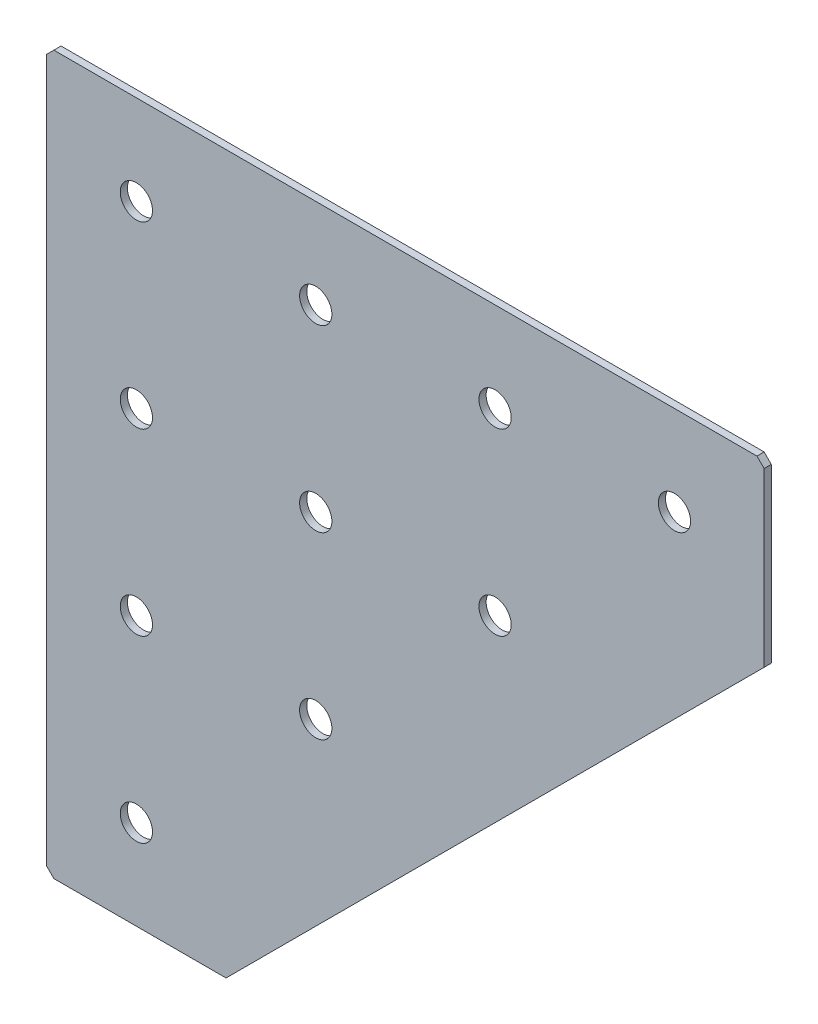
ISO-10303-21;
HEADER;
FILE_DESCRIPTION(('STEP AP214'),'2;1');
FILE_NAME('part.step','',(''),(''),'','','');
FILE_SCHEMA(('AUTOMOTIVE_DESIGN { 1 0 10303 214 1 1 1 1 }'));
ENDSEC;
DATA;
#1=APPLICATION_CONTEXT('core data for automotive mechanical design processes');
#2=APPLICATION_PROTOCOL_DEFINITION('international standard','automotive_design',2000,#1);
#3=PRODUCT_CONTEXT('',#1,'mechanical');
#4=PRODUCT('Part','Part','',(#3));
#5=PRODUCT_RELATED_PRODUCT_CATEGORY('part','',(#4));
#6=PRODUCT_DEFINITION_FORMATION('','',#4);
#7=PRODUCT_DEFINITION_CONTEXT('part definition',#1,'design');
#8=PRODUCT_DEFINITION('design','',#6,#7);
#9=PRODUCT_DEFINITION_SHAPE('','',#8);
#10=(LENGTH_UNIT() NAMED_UNIT(*) SI_UNIT(.MILLI.,.METRE.));
#11=(NAMED_UNIT(*) PLANE_ANGLE_UNIT() SI_UNIT($,.RADIAN.));
#12=(NAMED_UNIT(*) SI_UNIT($,.STERADIAN.) SOLID_ANGLE_UNIT());
#13=UNCERTAINTY_MEASURE_WITH_UNIT(LENGTH_MEASURE(1.E-05),#10,'distance_accuracy_value','');
#14=(GEOMETRIC_REPRESENTATION_CONTEXT(3) GLOBAL_UNCERTAINTY_ASSIGNED_CONTEXT((#13)) GLOBAL_UNIT_ASSIGNED_CONTEXT((#10,
#11,#12)) REPRESENTATION_CONTEXT('',''));
#15=CARTESIAN_POINT('',(0.,0.,0.));
#16=DIRECTION('',(0.,0.,1.));
#17=DIRECTION('',(1.,0.,0.));
#18=AXIS2_PLACEMENT_3D('',#15,#16,#17);
#19=CARTESIAN_POINT('',(0.,0.,0.));
#20=DIRECTION('',(0.,0.,-1.));
#21=DIRECTION('',(-1.,0.,0.));
#22=AXIS2_PLACEMENT_3D('',#19,#20,#21);
#23=PLANE('',#22);
#24=CARTESIAN_POINT('',(25.,-25.,0.));
#25=DIRECTION('',(0.,0.,1.));
#26=DIRECTION('',(1.,0.,0.));
#27=AXIS2_PLACEMENT_3D('',#24,#25,#26);
#28=CIRCLE('',#27,4.5);
#29=CARTESIAN_POINT('',(29.5,-25.,0.));
#30=VERTEX_POINT('',#29);
#31=EDGE_CURVE('E284',#30,#30,#28,.T.);
#32=ORIENTED_EDGE('',*,*,#31,.T.);
#33=EDGE_LOOP('',(#32));
#34=FACE_BOUND('',#33,.T.);
#35=CARTESIAN_POINT('',(75.,-25.,0.));
#36=DIRECTION('',(0.,0.,1.));
#37=DIRECTION('',(1.,0.,0.));
#38=AXIS2_PLACEMENT_3D('',#35,#36,#37);
#39=CIRCLE('',#38,4.5);
#40=CARTESIAN_POINT('',(79.5,-25.,0.));
#41=VERTEX_POINT('',#40);
#42=EDGE_CURVE('E276',#41,#41,#39,.T.);
#43=ORIENTED_EDGE('',*,*,#42,.T.);
#44=EDGE_LOOP('',(#43));
#45=FACE_BOUND('',#44,.T.);
#46=CARTESIAN_POINT('',(125.,-25.,0.));
#47=DIRECTION('',(0.,0.,1.));
#48=DIRECTION('',(1.,0.,0.));
#49=AXIS2_PLACEMENT_3D('',#46,#47,#48);
#50=CIRCLE('',#49,4.5);
#51=CARTESIAN_POINT('',(129.5,-25.,0.));
#52=VERTEX_POINT('',#51);
#53=EDGE_CURVE('E268',#52,#52,#50,.T.);
#54=ORIENTED_EDGE('',*,*,#53,.T.);
#55=EDGE_LOOP('',(#54));
#56=FACE_BOUND('',#55,.T.);
#57=CARTESIAN_POINT('',(175.,-25.,0.));
#58=DIRECTION('',(0.,0.,1.));
#59=DIRECTION('',(1.,0.,0.));
#60=AXIS2_PLACEMENT_3D('',#57,#58,#59);
#61=CIRCLE('',#60,4.5);
#62=CARTESIAN_POINT('',(179.5,-25.,0.));
#63=VERTEX_POINT('',#62);
#64=EDGE_CURVE('E260',#63,#63,#61,.T.);
#65=ORIENTED_EDGE('',*,*,#64,.T.);
#66=EDGE_LOOP('',(#65));
#67=FACE_BOUND('',#66,.T.);
#68=CARTESIAN_POINT('',(25.,-75.,0.));
#69=DIRECTION('',(0.,0.,1.));
#70=DIRECTION('',(1.,0.,0.));
#71=AXIS2_PLACEMENT_3D('',#68,#69,#70);
#72=CIRCLE('',#71,4.5);
#73=CARTESIAN_POINT('',(29.5,-75.,0.));
#74=VERTEX_POINT('',#73);
#75=EDGE_CURVE('E252',#74,#74,#72,.T.);
#76=ORIENTED_EDGE('',*,*,#75,.T.);
#77=EDGE_LOOP('',(#76));
#78=FACE_BOUND('',#77,.T.);
#79=CARTESIAN_POINT('',(25.,-125.,0.));
#80=DIRECTION('',(0.,0.,1.));
#81=DIRECTION('',(1.,0.,0.));
#82=AXIS2_PLACEMENT_3D('',#79,#80,#81);
#83=CIRCLE('',#82,4.5);
#84=CARTESIAN_POINT('',(29.5,-125.,0.));
#85=VERTEX_POINT('',#84);
#86=EDGE_CURVE('E244',#85,#85,#83,.T.);
#87=ORIENTED_EDGE('',*,*,#86,.T.);
#88=EDGE_LOOP('',(#87));
#89=FACE_BOUND('',#88,.T.);
#90=DIRECTION('',(1.,0.,0.));
#91=VECTOR('',#90,1.);
#92=CARTESIAN_POINT('',(0.,-200.,0.));
#93=LINE('',#92,#91);
#94=CARTESIAN_POINT('',(2.,-200.,0.));
#95=VERTEX_POINT('',#94);
#96=CARTESIAN_POINT('',(50.,-200.,0.));
#97=VERTEX_POINT('',#96);
#98=EDGE_CURVE('E127',#95,#97,#93,.T.);
#99=ORIENTED_EDGE('',*,*,#98,.F.);
#100=DIRECTION('',(0.707106781186543,-0.707106781186552,0.));
#101=VECTOR('',#100,1.);
#102=CARTESIAN_POINT('',(-99.,-98.9999999999986,0.));
#103=LINE('',#102,#101);
#104=CARTESIAN_POINT('',(0.,-198.,0.));
#105=VERTEX_POINT('',#104);
#106=EDGE_CURVE('E170',#95,#105,#103,.F.);
#107=ORIENTED_EDGE('',*,*,#106,.T.);
#108=DIRECTION('',(0.,-1.,0.));
#109=VECTOR('',#108,1.);
#110=CARTESIAN_POINT('',(0.,0.,0.));
#111=LINE('',#110,#109);
#112=CARTESIAN_POINT('',(0.,-1.99999999999997,0.));
#113=VERTEX_POINT('',#112);
#114=EDGE_CURVE('E146',#113,#105,#111,.T.);
#115=ORIENTED_EDGE('',*,*,#114,.F.);
#116=DIRECTION('',(-0.707106781186548,-0.707106781186548,0.));
#117=VECTOR('',#116,1.);
#118=CARTESIAN_POINT('',(0.999999999999987,-0.999999999999987,0.));
#119=LINE('',#118,#117);
#120=CARTESIAN_POINT('',(1.99999999999997,0.,0.));
#121=VERTEX_POINT('',#120);
#122=EDGE_CURVE('E167',#113,#121,#119,.F.);
#123=ORIENTED_EDGE('',*,*,#122,.T.);
#124=DIRECTION('',(-1.,0.,0.));
#125=VECTOR('',#124,1.);
#126=CARTESIAN_POINT('',(0.,0.,0.));
#127=LINE('',#126,#125);
#128=CARTESIAN_POINT('',(198.,0.,0.));
#129=VERTEX_POINT('',#128);
#130=EDGE_CURVE('E143',#129,#121,#127,.T.);
#131=ORIENTED_EDGE('',*,*,#130,.F.);
#132=DIRECTION('',(-0.707106781186548,0.707106781186548,0.));
#133=VECTOR('',#132,1.);
#134=CARTESIAN_POINT('',(99.,99.,0.));
#135=LINE('',#134,#133);
#136=CARTESIAN_POINT('',(200.,-2.00000000000003,0.));
#137=VERTEX_POINT('',#136);
#138=EDGE_CURVE('E164',#129,#137,#135,.F.);
#139=ORIENTED_EDGE('',*,*,#138,.T.);
#140=DIRECTION('',(0.,1.,0.));
#141=VECTOR('',#140,1.);
#142=CARTESIAN_POINT('',(200.,0.,0.));
#143=LINE('',#142,#141);
#144=CARTESIAN_POINT('',(200.,-50.,0.));
#145=VERTEX_POINT('',#144);
#146=EDGE_CURVE('E156',#145,#137,#143,.T.);
#147=ORIENTED_EDGE('',*,*,#146,.F.);
#148=DIRECTION('',(0.707106781186547,0.707106781186548,0.));
#149=VECTOR('',#148,1.);
#150=CARTESIAN_POINT('',(200.,-50.,0.));
#151=LINE('',#150,#149);
#152=EDGE_CURVE('E153',#97,#145,#151,.T.);
#153=ORIENTED_EDGE('',*,*,#152,.F.);
#154=EDGE_LOOP('',(#99,#107,#115,#123,#131,#139,#147,#153));
#155=FACE_BOUND('',#154,.T.);
#156=CARTESIAN_POINT('',(75.,-75.,0.));
#157=DIRECTION('',(0.,0.,1.));
#158=DIRECTION('',(1.,0.,0.));
#159=AXIS2_PLACEMENT_3D('',#156,#157,#158);
#160=CIRCLE('',#159,4.5);
#161=CARTESIAN_POINT('',(79.5,-75.,0.));
#162=VERTEX_POINT('',#161);
#163=EDGE_CURVE('E147',#162,#162,#160,.T.);
#164=ORIENTED_EDGE('',*,*,#163,.T.);
#165=EDGE_LOOP('',(#164));
#166=FACE_BOUND('',#165,.T.);
#167=CARTESIAN_POINT('',(125.,-75.,0.));
#168=DIRECTION('',(0.,0.,1.));
#169=DIRECTION('',(1.,0.,0.));
#170=AXIS2_PLACEMENT_3D('',#167,#168,#169);
#171=CIRCLE('',#170,4.5);
#172=CARTESIAN_POINT('',(129.5,-75.,0.));
#173=VERTEX_POINT('',#172);
#174=EDGE_CURVE('E220',#173,#173,#171,.T.);
#175=ORIENTED_EDGE('',*,*,#174,.T.);
#176=EDGE_LOOP('',(#175));
#177=FACE_BOUND('',#176,.T.);
#178=CARTESIAN_POINT('',(75.,-125.,0.));
#179=DIRECTION('',(0.,0.,1.));
#180=DIRECTION('',(1.,0.,0.));
#181=AXIS2_PLACEMENT_3D('',#178,#179,#180);
#182=CIRCLE('',#181,4.5);
#183=CARTESIAN_POINT('',(79.5,-125.,0.));
#184=VERTEX_POINT('',#183);
#185=EDGE_CURVE('E228',#184,#184,#182,.T.);
#186=ORIENTED_EDGE('',*,*,#185,.T.);
#187=EDGE_LOOP('',(#186));
#188=FACE_BOUND('',#187,.T.);
#189=CARTESIAN_POINT('',(25.,-175.,0.));
#190=DIRECTION('',(0.,0.,1.));
#191=DIRECTION('',(1.,0.,0.));
#192=AXIS2_PLACEMENT_3D('',#189,#190,#191);
#193=CIRCLE('',#192,4.5);
#194=CARTESIAN_POINT('',(29.5,-175.,0.));
#195=VERTEX_POINT('',#194);
#196=EDGE_CURVE('E236',#195,#195,#193,.T.);
#197=ORIENTED_EDGE('',*,*,#196,.T.);
#198=EDGE_LOOP('',(#197));
#199=FACE_BOUND('',#198,.T.);
#200=ADVANCED_FACE('F41',(#34,#45,#56,#67,#78,#89,#155,#166,#177,#188,#199),#23,.T.);
#201=CARTESIAN_POINT('',(0.,0.,2.));
#202=DIRECTION('',(0.,-1.,0.));
#203=DIRECTION('',(0.,0.,-1.));
#204=AXIS2_PLACEMENT_3D('',#201,#202,#203);
#205=PLANE('',#204);
#206=ORIENTED_EDGE('',*,*,#130,.T.);
#207=DIRECTION('',(0.,0.,1.));
#208=VECTOR('',#207,1.);
#209=CARTESIAN_POINT('',(1.99999999999997,0.,2.));
#210=LINE('',#209,#208);
#211=CARTESIAN_POINT('',(1.99999999999997,0.,2.));
#212=VERTEX_POINT('',#211);
#213=EDGE_CURVE('E51',#121,#212,#210,.T.);
#214=ORIENTED_EDGE('',*,*,#213,.T.);
#215=DIRECTION('',(-1.,0.,0.));
#216=VECTOR('',#215,1.);
#217=CARTESIAN_POINT('',(0.,0.,2.));
#218=LINE('',#217,#216);
#219=CARTESIAN_POINT('',(198.,0.,2.));
#220=VERTEX_POINT('',#219);
#221=EDGE_CURVE('E159',#220,#212,#218,.T.);
#222=ORIENTED_EDGE('',*,*,#221,.F.);
#223=DIRECTION('',(0.,0.,-1.));
#224=VECTOR('',#223,1.);
#225=CARTESIAN_POINT('',(198.,0.,2.));
#226=LINE('',#225,#224);
#227=EDGE_CURVE('E188',#220,#129,#226,.T.);
#228=ORIENTED_EDGE('',*,*,#227,.T.);
#229=EDGE_LOOP('',(#206,#214,#222,#228));
#230=FACE_BOUND('',#229,.T.);
#231=ADVANCED_FACE('F194',(#230),#205,.F.);
#232=CARTESIAN_POINT('',(0.,0.,2.));
#233=DIRECTION('',(1.,0.,0.));
#234=DIRECTION('',(0.,1.,0.));
#235=AXIS2_PLACEMENT_3D('',#232,#233,#234);
#236=PLANE('',#235);
#237=ORIENTED_EDGE('',*,*,#114,.T.);
#238=DIRECTION('',(0.,0.,1.));
#239=VECTOR('',#238,1.);
#240=CARTESIAN_POINT('',(0.,-198.,2.));
#241=LINE('',#240,#239);
#242=CARTESIAN_POINT('',(0.,-198.,2.));
#243=VERTEX_POINT('',#242);
#244=EDGE_CURVE('E177',#105,#243,#241,.T.);
#245=ORIENTED_EDGE('',*,*,#244,.T.);
#246=DIRECTION('',(0.,-1.,0.));
#247=VECTOR('',#246,1.);
#248=CARTESIAN_POINT('',(0.,0.,2.));
#249=LINE('',#248,#247);
#250=CARTESIAN_POINT('',(0.,-1.99999999999997,2.));
#251=VERTEX_POINT('',#250);
#252=EDGE_CURVE('E121',#251,#243,#249,.T.);
#253=ORIENTED_EDGE('',*,*,#252,.F.);
#254=DIRECTION('',(0.,0.,-1.));
#255=VECTOR('',#254,1.);
#256=CARTESIAN_POINT('',(0.,-1.99999999999997,2.));
#257=LINE('',#256,#255);
#258=EDGE_CURVE('E173',#251,#113,#257,.T.);
#259=ORIENTED_EDGE('',*,*,#258,.T.);
#260=EDGE_LOOP('',(#237,#245,#253,#259));
#261=FACE_BOUND('',#260,.T.);
#262=ADVANCED_FACE('F207',(#261),#236,.F.);
#263=CARTESIAN_POINT('',(0.,-200.,2.));
#264=DIRECTION('',(0.,1.,0.));
#265=DIRECTION('',(0.,0.,1.));
#266=AXIS2_PLACEMENT_3D('',#263,#264,#265);
#267=PLANE('',#266);
#268=DIRECTION('',(1.,0.,0.));
#269=VECTOR('',#268,1.);
#270=CARTESIAN_POINT('',(0.,-200.,2.));
#271=LINE('',#270,#269);
#272=CARTESIAN_POINT('',(2.,-200.,2.));
#273=VERTEX_POINT('',#272);
#274=CARTESIAN_POINT('',(50.,-200.,2.));
#275=VERTEX_POINT('',#274);
#276=EDGE_CURVE('E108',#273,#275,#271,.T.);
#277=ORIENTED_EDGE('',*,*,#276,.F.);
#278=DIRECTION('',(0.,0.,-1.));
#279=VECTOR('',#278,1.);
#280=CARTESIAN_POINT('',(2.,-200.,2.));
#281=LINE('',#280,#279);
#282=EDGE_CURVE('E131',#273,#95,#281,.T.);
#283=ORIENTED_EDGE('',*,*,#282,.T.);
#284=ORIENTED_EDGE('',*,*,#98,.T.);
#285=DIRECTION('',(0.,0.,-1.));
#286=VECTOR('',#285,1.);
#287=CARTESIAN_POINT('',(50.,-200.,2.));
#288=LINE('',#287,#286);
#289=EDGE_CURVE('E124',#275,#97,#288,.T.);
#290=ORIENTED_EDGE('',*,*,#289,.F.);
#291=EDGE_LOOP('',(#277,#283,#284,#290));
#292=FACE_BOUND('',#291,.T.);
#293=ADVANCED_FACE('F125',(#292),#267,.F.);
#294=CARTESIAN_POINT('',(200.,-50.,2.));
#295=DIRECTION('',(-0.707106781186548,0.707106781186547,0.));
#296=DIRECTION('',(-0.707106781186547,-0.707106781186548,0.));
#297=AXIS2_PLACEMENT_3D('',#294,#295,#296);
#298=PLANE('',#297);
#299=ORIENTED_EDGE('',*,*,#152,.T.);
#300=DIRECTION('',(0.,0.,-1.));
#301=VECTOR('',#300,1.);
#302=CARTESIAN_POINT('',(200.,-50.,2.));
#303=LINE('',#302,#301);
#304=CARTESIAN_POINT('',(200.,-50.,2.));
#305=VERTEX_POINT('',#304);
#306=EDGE_CURVE('E132',#305,#145,#303,.T.);
#307=ORIENTED_EDGE('',*,*,#306,.F.);
#308=DIRECTION('',(0.707106781186547,0.707106781186548,0.));
#309=VECTOR('',#308,1.);
#310=CARTESIAN_POINT('',(200.,-50.,2.));
#311=LINE('',#310,#309);
#312=EDGE_CURVE('E113',#275,#305,#311,.T.);
#313=ORIENTED_EDGE('',*,*,#312,.F.);
#314=ORIENTED_EDGE('',*,*,#289,.T.);
#315=EDGE_LOOP('',(#299,#307,#313,#314));
#316=FACE_BOUND('',#315,.T.);
#317=ADVANCED_FACE('F134',(#316),#298,.F.);
#318=CARTESIAN_POINT('',(200.,0.,2.));
#319=DIRECTION('',(-1.,0.,0.));
#320=DIRECTION('',(0.,0.,1.));
#321=AXIS2_PLACEMENT_3D('',#318,#319,#320);
#322=PLANE('',#321);
#323=ORIENTED_EDGE('',*,*,#146,.T.);
#324=DIRECTION('',(0.,0.,1.));
#325=VECTOR('',#324,1.);
#326=CARTESIAN_POINT('',(200.,-2.00000000000003,2.));
#327=LINE('',#326,#325);
#328=CARTESIAN_POINT('',(200.,-2.00000000000003,2.));
#329=VERTEX_POINT('',#328);
#330=EDGE_CURVE('E11',#137,#329,#327,.T.);
#331=ORIENTED_EDGE('',*,*,#330,.T.);
#332=DIRECTION('',(0.,1.,0.));
#333=VECTOR('',#332,1.);
#334=CARTESIAN_POINT('',(200.,0.,2.));
#335=LINE('',#334,#333);
#336=EDGE_CURVE('E137',#305,#329,#335,.T.);
#337=ORIENTED_EDGE('',*,*,#336,.F.);
#338=ORIENTED_EDGE('',*,*,#306,.T.);
#339=EDGE_LOOP('',(#323,#331,#337,#338));
#340=FACE_BOUND('',#339,.T.);
#341=ADVANCED_FACE('F298',(#340),#322,.F.);
#342=CARTESIAN_POINT('',(0.,0.,2.));
#343=DIRECTION('',(0.,0.,-1.));
#344=DIRECTION('',(-1.,0.,0.));
#345=AXIS2_PLACEMENT_3D('',#342,#343,#344);
#346=PLANE('',#345);
#347=CARTESIAN_POINT('',(25.,-25.,2.));
#348=DIRECTION('',(0.,0.,1.));
#349=DIRECTION('',(1.,0.,0.));
#350=AXIS2_PLACEMENT_3D('',#347,#348,#349);
#351=CIRCLE('',#350,4.5);
#352=CARTESIAN_POINT('',(29.5,-25.,2.));
#353=VERTEX_POINT('',#352);
#354=EDGE_CURVE('E288',#353,#353,#351,.T.);
#355=ORIENTED_EDGE('',*,*,#354,.F.);
#356=EDGE_LOOP('',(#355));
#357=FACE_BOUND('',#356,.T.);
#358=CARTESIAN_POINT('',(75.,-25.,2.));
#359=DIRECTION('',(0.,0.,1.));
#360=DIRECTION('',(1.,0.,0.));
#361=AXIS2_PLACEMENT_3D('',#358,#359,#360);
#362=CIRCLE('',#361,4.5);
#363=CARTESIAN_POINT('',(79.5,-25.,2.));
#364=VERTEX_POINT('',#363);
#365=EDGE_CURVE('E280',#364,#364,#362,.T.);
#366=ORIENTED_EDGE('',*,*,#365,.F.);
#367=EDGE_LOOP('',(#366));
#368=FACE_BOUND('',#367,.T.);
#369=CARTESIAN_POINT('',(125.,-25.,2.));
#370=DIRECTION('',(0.,0.,1.));
#371=DIRECTION('',(1.,0.,0.));
#372=AXIS2_PLACEMENT_3D('',#369,#370,#371);
#373=CIRCLE('',#372,4.5);
#374=CARTESIAN_POINT('',(129.5,-25.,2.));
#375=VERTEX_POINT('',#374);
#376=EDGE_CURVE('E272',#375,#375,#373,.T.);
#377=ORIENTED_EDGE('',*,*,#376,.F.);
#378=EDGE_LOOP('',(#377));
#379=FACE_BOUND('',#378,.T.);
#380=CARTESIAN_POINT('',(175.,-25.,2.));
#381=DIRECTION('',(0.,0.,1.));
#382=DIRECTION('',(1.,0.,0.));
#383=AXIS2_PLACEMENT_3D('',#380,#381,#382);
#384=CIRCLE('',#383,4.5);
#385=CARTESIAN_POINT('',(179.5,-25.,2.));
#386=VERTEX_POINT('',#385);
#387=EDGE_CURVE('E264',#386,#386,#384,.T.);
#388=ORIENTED_EDGE('',*,*,#387,.F.);
#389=EDGE_LOOP('',(#388));
#390=FACE_BOUND('',#389,.T.);
#391=CARTESIAN_POINT('',(25.,-75.,2.));
#392=DIRECTION('',(0.,0.,1.));
#393=DIRECTION('',(1.,0.,0.));
#394=AXIS2_PLACEMENT_3D('',#391,#392,#393);
#395=CIRCLE('',#394,4.5);
#396=CARTESIAN_POINT('',(29.5,-75.,2.));
#397=VERTEX_POINT('',#396);
#398=EDGE_CURVE('E256',#397,#397,#395,.T.);
#399=ORIENTED_EDGE('',*,*,#398,.F.);
#400=EDGE_LOOP('',(#399));
#401=FACE_BOUND('',#400,.T.);
#402=CARTESIAN_POINT('',(25.,-125.,2.));
#403=DIRECTION('',(0.,0.,1.));
#404=DIRECTION('',(1.,0.,0.));
#405=AXIS2_PLACEMENT_3D('',#402,#403,#404);
#406=CIRCLE('',#405,4.5);
#407=CARTESIAN_POINT('',(29.5,-125.,2.));
#408=VERTEX_POINT('',#407);
#409=EDGE_CURVE('E248',#408,#408,#406,.T.);
#410=ORIENTED_EDGE('',*,*,#409,.F.);
#411=EDGE_LOOP('',(#410));
#412=FACE_BOUND('',#411,.T.);
#413=CARTESIAN_POINT('',(25.,-175.,2.));
#414=DIRECTION('',(0.,0.,1.));
#415=DIRECTION('',(1.,0.,0.));
#416=AXIS2_PLACEMENT_3D('',#413,#414,#415);
#417=CIRCLE('',#416,4.5);
#418=CARTESIAN_POINT('',(29.5,-175.,2.));
#419=VERTEX_POINT('',#418);
#420=EDGE_CURVE('E240',#419,#419,#417,.T.);
#421=ORIENTED_EDGE('',*,*,#420,.F.);
#422=EDGE_LOOP('',(#421));
#423=FACE_BOUND('',#422,.T.);
#424=CARTESIAN_POINT('',(75.,-125.,2.));
#425=DIRECTION('',(0.,0.,1.));
#426=DIRECTION('',(1.,0.,0.));
#427=AXIS2_PLACEMENT_3D('',#424,#425,#426);
#428=CIRCLE('',#427,4.5);
#429=CARTESIAN_POINT('',(79.5,-125.,2.));
#430=VERTEX_POINT('',#429);
#431=EDGE_CURVE('E232',#430,#430,#428,.T.);
#432=ORIENTED_EDGE('',*,*,#431,.F.);
#433=EDGE_LOOP('',(#432));
#434=FACE_BOUND('',#433,.T.);
#435=CARTESIAN_POINT('',(125.,-75.,2.));
#436=DIRECTION('',(0.,0.,1.));
#437=DIRECTION('',(1.,0.,0.));
#438=AXIS2_PLACEMENT_3D('',#435,#436,#437);
#439=CIRCLE('',#438,4.5);
#440=CARTESIAN_POINT('',(129.5,-75.,2.));
#441=VERTEX_POINT('',#440);
#442=EDGE_CURVE('E224',#441,#441,#439,.T.);
#443=ORIENTED_EDGE('',*,*,#442,.F.);
#444=EDGE_LOOP('',(#443));
#445=FACE_BOUND('',#444,.T.);
#446=CARTESIAN_POINT('',(75.,-75.,2.));
#447=DIRECTION('',(0.,0.,1.));
#448=DIRECTION('',(1.,0.,0.));
#449=AXIS2_PLACEMENT_3D('',#446,#447,#448);
#450=CIRCLE('',#449,4.5);
#451=CARTESIAN_POINT('',(79.5,-75.,2.));
#452=VERTEX_POINT('',#451);
#453=EDGE_CURVE('E216',#452,#452,#450,.T.);
#454=ORIENTED_EDGE('',*,*,#453,.F.);
#455=EDGE_LOOP('',(#454));
#456=FACE_BOUND('',#455,.T.);
#457=ORIENTED_EDGE('',*,*,#252,.T.);
#458=DIRECTION('',(-0.707106781186543,0.707106781186552,0.));
#459=VECTOR('',#458,1.);
#460=CARTESIAN_POINT('',(2.,-200.,2.));
#461=LINE('',#460,#459);
#462=EDGE_CURVE('E116',#243,#273,#461,.F.);
#463=ORIENTED_EDGE('',*,*,#462,.T.);
#464=ORIENTED_EDGE('',*,*,#276,.T.);
#465=ORIENTED_EDGE('',*,*,#312,.T.);
#466=ORIENTED_EDGE('',*,*,#336,.T.);
#467=DIRECTION('',(0.707106781186548,-0.707106781186548,0.));
#468=VECTOR('',#467,1.);
#469=CARTESIAN_POINT('',(198.,0.,2.));
#470=LINE('',#469,#468);
#471=EDGE_CURVE('E180',#329,#220,#470,.F.);
#472=ORIENTED_EDGE('',*,*,#471,.T.);
#473=ORIENTED_EDGE('',*,*,#221,.T.);
#474=DIRECTION('',(0.707106781186548,0.707106781186548,0.));
#475=VECTOR('',#474,1.);
#476=CARTESIAN_POINT('',(0.,-1.99999999999997,2.));
#477=LINE('',#476,#475);
#478=EDGE_CURVE('E183',#212,#251,#477,.F.);
#479=ORIENTED_EDGE('',*,*,#478,.T.);
#480=EDGE_LOOP('',(#457,#463,#464,#465,#466,#472,#473,#479));
#481=FACE_BOUND('',#480,.T.);
#482=ADVANCED_FACE('F111',(#357,#368,#379,#390,#401,#412,#423,#434,#445,#456,#481),#346,.F.);
#483=CARTESIAN_POINT('',(2.,-200.,2.));
#484=DIRECTION('',(0.707106781186552,0.707106781186543,0.));
#485=DIRECTION('',(0.,0.,-1.));
#486=AXIS2_PLACEMENT_3D('',#483,#484,#485);
#487=PLANE('',#486);
#488=ORIENTED_EDGE('',*,*,#462,.F.);
#489=ORIENTED_EDGE('',*,*,#244,.F.);
#490=ORIENTED_EDGE('',*,*,#106,.F.);
#491=ORIENTED_EDGE('',*,*,#282,.F.);
#492=EDGE_LOOP('',(#488,#489,#490,#491));
#493=FACE_BOUND('',#492,.T.);
#494=ADVANCED_FACE('F297',(#493),#487,.F.);
#495=CARTESIAN_POINT('',(0.,-1.99999999999997,2.));
#496=DIRECTION('',(0.707106781186547,-0.707106781186547,0.));
#497=DIRECTION('',(0.,0.,-1.));
#498=AXIS2_PLACEMENT_3D('',#495,#496,#497);
#499=PLANE('',#498);
#500=ORIENTED_EDGE('',*,*,#478,.F.);
#501=ORIENTED_EDGE('',*,*,#213,.F.);
#502=ORIENTED_EDGE('',*,*,#122,.F.);
#503=ORIENTED_EDGE('',*,*,#258,.F.);
#504=EDGE_LOOP('',(#500,#501,#502,#503));
#505=FACE_BOUND('',#504,.T.);
#506=ADVANCED_FACE('F204',(#505),#499,.F.);
#507=CARTESIAN_POINT('',(198.,0.,2.));
#508=DIRECTION('',(-0.707106781186547,-0.707106781186547,0.));
#509=DIRECTION('',(0.,0.,-1.));
#510=AXIS2_PLACEMENT_3D('',#507,#508,#509);
#511=PLANE('',#510);
#512=ORIENTED_EDGE('',*,*,#471,.F.);
#513=ORIENTED_EDGE('',*,*,#330,.F.);
#514=ORIENTED_EDGE('',*,*,#138,.F.);
#515=ORIENTED_EDGE('',*,*,#227,.F.);
#516=EDGE_LOOP('',(#512,#513,#514,#515));
#517=FACE_BOUND('',#516,.T.);
#518=ADVANCED_FACE('F44',(#517),#511,.F.);
#519=CARTESIAN_POINT('',(75.,-75.,2.));
#520=DIRECTION('',(0.,0.,1.));
#521=DIRECTION('',(1.,0.,0.));
#522=AXIS2_PLACEMENT_3D('',#519,#520,#521);
#523=CYLINDRICAL_SURFACE('',#522,4.5);
#524=ORIENTED_EDGE('',*,*,#163,.F.);
#525=EDGE_LOOP('',(#524));
#526=FACE_BOUND('',#525,.T.);
#527=ORIENTED_EDGE('',*,*,#453,.T.);
#528=EDGE_LOOP('',(#527));
#529=FACE_BOUND('',#528,.T.);
#530=ADVANCED_FACE('F318',(#526,#529),#523,.F.);
#531=CARTESIAN_POINT('',(125.,-75.,2.));
#532=DIRECTION('',(0.,0.,1.));
#533=DIRECTION('',(1.,0.,0.));
#534=AXIS2_PLACEMENT_3D('',#531,#532,#533);
#535=CYLINDRICAL_SURFACE('',#534,4.5);
#536=ORIENTED_EDGE('',*,*,#174,.F.);
#537=EDGE_LOOP('',(#536));
#538=FACE_BOUND('',#537,.T.);
#539=ORIENTED_EDGE('',*,*,#442,.T.);
#540=EDGE_LOOP('',(#539));
#541=FACE_BOUND('',#540,.T.);
#542=ADVANCED_FACE('F320',(#538,#541),#535,.F.);
#543=CARTESIAN_POINT('',(75.,-125.,2.));
#544=DIRECTION('',(0.,0.,1.));
#545=DIRECTION('',(1.,0.,0.));
#546=AXIS2_PLACEMENT_3D('',#543,#544,#545);
#547=CYLINDRICAL_SURFACE('',#546,4.5);
#548=ORIENTED_EDGE('',*,*,#185,.F.);
#549=EDGE_LOOP('',(#548));
#550=FACE_BOUND('',#549,.T.);
#551=ORIENTED_EDGE('',*,*,#431,.T.);
#552=EDGE_LOOP('',(#551));
#553=FACE_BOUND('',#552,.T.);
#554=ADVANCED_FACE('F327',(#550,#553),#547,.F.);
#555=CARTESIAN_POINT('',(25.,-175.,2.));
#556=DIRECTION('',(0.,0.,1.));
#557=DIRECTION('',(1.,0.,0.));
#558=AXIS2_PLACEMENT_3D('',#555,#556,#557);
#559=CYLINDRICAL_SURFACE('',#558,4.5);
#560=ORIENTED_EDGE('',*,*,#196,.F.);
#561=EDGE_LOOP('',(#560));
#562=FACE_BOUND('',#561,.T.);
#563=ORIENTED_EDGE('',*,*,#420,.T.);
#564=EDGE_LOOP('',(#563));
#565=FACE_BOUND('',#564,.T.);
#566=ADVANCED_FACE('F396',(#562,#565),#559,.F.);
#567=CARTESIAN_POINT('',(25.,-125.,2.));
#568=DIRECTION('',(0.,0.,1.));
#569=DIRECTION('',(1.,0.,0.));
#570=AXIS2_PLACEMENT_3D('',#567,#568,#569);
#571=CYLINDRICAL_SURFACE('',#570,4.5);
#572=ORIENTED_EDGE('',*,*,#86,.F.);
#573=EDGE_LOOP('',(#572));
#574=FACE_BOUND('',#573,.T.);
#575=ORIENTED_EDGE('',*,*,#409,.T.);
#576=EDGE_LOOP('',(#575));
#577=FACE_BOUND('',#576,.T.);
#578=ADVANCED_FACE('F406',(#574,#577),#571,.F.);
#579=CARTESIAN_POINT('',(25.,-75.,2.));
#580=DIRECTION('',(0.,0.,1.));
#581=DIRECTION('',(1.,0.,0.));
#582=AXIS2_PLACEMENT_3D('',#579,#580,#581);
#583=CYLINDRICAL_SURFACE('',#582,4.5);
#584=ORIENTED_EDGE('',*,*,#75,.F.);
#585=EDGE_LOOP('',(#584));
#586=FACE_BOUND('',#585,.T.);
#587=ORIENTED_EDGE('',*,*,#398,.T.);
#588=EDGE_LOOP('',(#587));
#589=FACE_BOUND('',#588,.T.);
#590=ADVANCED_FACE('F416',(#586,#589),#583,.F.);
#591=CARTESIAN_POINT('',(175.,-25.,2.));
#592=DIRECTION('',(0.,0.,1.));
#593=DIRECTION('',(1.,0.,0.));
#594=AXIS2_PLACEMENT_3D('',#591,#592,#593);
#595=CYLINDRICAL_SURFACE('',#594,4.5);
#596=ORIENTED_EDGE('',*,*,#64,.F.);
#597=EDGE_LOOP('',(#596));
#598=FACE_BOUND('',#597,.T.);
#599=ORIENTED_EDGE('',*,*,#387,.T.);
#600=EDGE_LOOP('',(#599));
#601=FACE_BOUND('',#600,.T.);
#602=ADVANCED_FACE('F426',(#598,#601),#595,.F.);
#603=CARTESIAN_POINT('',(125.,-25.,2.));
#604=DIRECTION('',(0.,0.,1.));
#605=DIRECTION('',(1.,0.,0.));
#606=AXIS2_PLACEMENT_3D('',#603,#604,#605);
#607=CYLINDRICAL_SURFACE('',#606,4.5);
#608=ORIENTED_EDGE('',*,*,#53,.F.);
#609=EDGE_LOOP('',(#608));
#610=FACE_BOUND('',#609,.T.);
#611=ORIENTED_EDGE('',*,*,#376,.T.);
#612=EDGE_LOOP('',(#611));
#613=FACE_BOUND('',#612,.T.);
#614=ADVANCED_FACE('F436',(#610,#613),#607,.F.);
#615=CARTESIAN_POINT('',(75.,-25.,2.));
#616=DIRECTION('',(0.,0.,1.));
#617=DIRECTION('',(1.,0.,0.));
#618=AXIS2_PLACEMENT_3D('',#615,#616,#617);
#619=CYLINDRICAL_SURFACE('',#618,4.5);
#620=ORIENTED_EDGE('',*,*,#42,.F.);
#621=EDGE_LOOP('',(#620));
#622=FACE_BOUND('',#621,.T.);
#623=ORIENTED_EDGE('',*,*,#365,.T.);
#624=EDGE_LOOP('',(#623));
#625=FACE_BOUND('',#624,.T.);
#626=ADVANCED_FACE('F446',(#622,#625),#619,.F.);
#627=CARTESIAN_POINT('',(25.,-25.,2.));
#628=DIRECTION('',(0.,0.,1.));
#629=DIRECTION('',(1.,0.,0.));
#630=AXIS2_PLACEMENT_3D('',#627,#628,#629);
#631=CYLINDRICAL_SURFACE('',#630,4.5);
#632=ORIENTED_EDGE('',*,*,#31,.F.);
#633=EDGE_LOOP('',(#632));
#634=FACE_BOUND('',#633,.T.);
#635=ORIENTED_EDGE('',*,*,#354,.T.);
#636=EDGE_LOOP('',(#635));
#637=FACE_BOUND('',#636,.T.);
#638=ADVANCED_FACE('F293',(#634,#637),#631,.F.);
#639=CLOSED_SHELL('',(#200,#231,#262,#293,#317,#341,#482,#494,#506,#518,#530,#542,#554,#566,
#578,#590,#602,#614,#626,#638));
#640=MANIFOLD_SOLID_BREP('B2',#639);
#641=ADVANCED_BREP_SHAPE_REPRESENTATION('',(#18,#640),#14);
#642=SHAPE_DEFINITION_REPRESENTATION(#9,#641);
ENDSEC;
END-ISO-10303-21;
